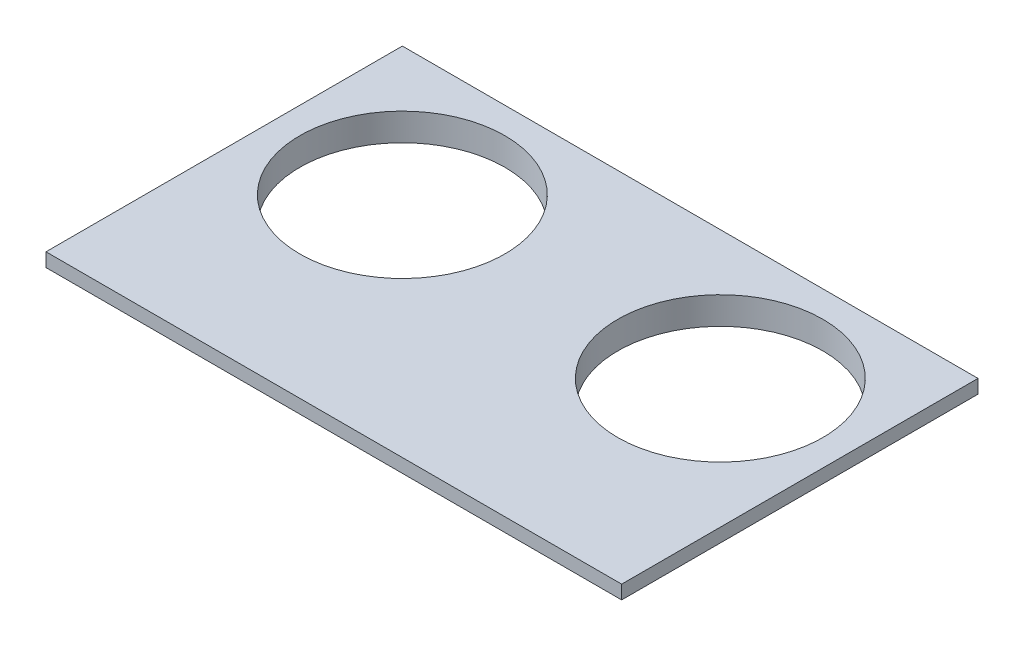
ISO-10303-21;
HEADER;
FILE_DESCRIPTION(('STEP AP214'),'2;1');
FILE_NAME('part.step','',(''),(''),'','','');
FILE_SCHEMA(('AUTOMOTIVE_DESIGN { 1 0 10303 214 1 1 1 1 }'));
ENDSEC;
DATA;
#1=APPLICATION_CONTEXT('core data for automotive mechanical design processes');
#2=APPLICATION_PROTOCOL_DEFINITION('international standard','automotive_design',2000,#1);
#3=PRODUCT_CONTEXT('',#1,'mechanical');
#4=PRODUCT('Part','Part','',(#3));
#5=PRODUCT_RELATED_PRODUCT_CATEGORY('part','',(#4));
#6=PRODUCT_DEFINITION_FORMATION('','',#4);
#7=PRODUCT_DEFINITION_CONTEXT('part definition',#1,'design');
#8=PRODUCT_DEFINITION('design','',#6,#7);
#9=PRODUCT_DEFINITION_SHAPE('','',#8);
#10=(LENGTH_UNIT() NAMED_UNIT(*) SI_UNIT(.MILLI.,.METRE.));
#11=(NAMED_UNIT(*) PLANE_ANGLE_UNIT() SI_UNIT($,.RADIAN.));
#12=(NAMED_UNIT(*) SI_UNIT($,.STERADIAN.) SOLID_ANGLE_UNIT());
#13=UNCERTAINTY_MEASURE_WITH_UNIT(LENGTH_MEASURE(1.E-05),#10,'distance_accuracy_value','');
#14=(GEOMETRIC_REPRESENTATION_CONTEXT(3) GLOBAL_UNCERTAINTY_ASSIGNED_CONTEXT((#13)) GLOBAL_UNIT_ASSIGNED_CONTEXT((#10,
#11,#12)) REPRESENTATION_CONTEXT('',''));
#15=CARTESIAN_POINT('',(0.,0.,0.));
#16=DIRECTION('',(0.,0.,1.));
#17=DIRECTION('',(1.,0.,0.));
#18=AXIS2_PLACEMENT_3D('',#15,#16,#17);
#19=CARTESIAN_POINT('',(52.5,5.,32.5));
#20=DIRECTION('',(-1.,0.,0.));
#21=DIRECTION('',(0.,0.,1.));
#22=AXIS2_PLACEMENT_3D('',#19,#20,#21);
#23=PLANE('',#22);
#24=DIRECTION('',(0.,-1.,0.));
#25=VECTOR('',#24,1.);
#26=CARTESIAN_POINT('',(52.5,5.,32.5));
#27=LINE('',#26,#25);
#28=CARTESIAN_POINT('',(52.5,5.,32.5));
#29=VERTEX_POINT('',#28);
#30=CARTESIAN_POINT('',(52.5,2.5,32.5));
#31=VERTEX_POINT('',#30);
#32=EDGE_CURVE('E189',#29,#31,#27,.T.);
#33=ORIENTED_EDGE('',*,*,#32,.T.);
#34=DIRECTION('',(0.,0.,1.));
#35=VECTOR('',#34,1.);
#36=CARTESIAN_POINT('',(52.5,2.5,-32.5));
#37=LINE('',#36,#35);
#38=CARTESIAN_POINT('',(52.5,2.5,-32.5));
#39=VERTEX_POINT('',#38);
#40=EDGE_CURVE('E60',#39,#31,#37,.T.);
#41=ORIENTED_EDGE('',*,*,#40,.F.);
#42=DIRECTION('',(0.,-1.,0.));
#43=VECTOR('',#42,1.);
#44=CARTESIAN_POINT('',(52.5,5.,-32.5));
#45=LINE('',#44,#43);
#46=CARTESIAN_POINT('',(52.5,5.,-32.5));
#47=VERTEX_POINT('',#46);
#48=EDGE_CURVE('E11',#47,#39,#45,.T.);
#49=ORIENTED_EDGE('',*,*,#48,.F.);
#50=DIRECTION('',(0.,0.,-1.));
#51=VECTOR('',#50,1.);
#52=CARTESIAN_POINT('',(52.5,5.,32.5));
#53=LINE('',#52,#51);
#54=EDGE_CURVE('E176',#29,#47,#53,.T.);
#55=ORIENTED_EDGE('',*,*,#54,.F.);
#56=EDGE_LOOP('',(#33,#41,#49,#55));
#57=FACE_BOUND('',#56,.T.);
#58=ADVANCED_FACE('F43',(#57),#23,.F.);
#59=CARTESIAN_POINT('',(-52.5,5.,-32.5));
#60=DIRECTION('',(0.,0.,1.));
#61=DIRECTION('',(1.,0.,0.));
#62=AXIS2_PLACEMENT_3D('',#59,#60,#61);
#63=PLANE('',#62);
#64=ORIENTED_EDGE('',*,*,#48,.T.);
#65=DIRECTION('',(1.,0.,0.));
#66=VECTOR('',#65,1.);
#67=CARTESIAN_POINT('',(-52.5,2.5,-32.5));
#68=LINE('',#67,#66);
#69=CARTESIAN_POINT('',(-52.5,2.5,-32.5));
#70=VERTEX_POINT('',#69);
#71=EDGE_CURVE('E173',#70,#39,#68,.T.);
#72=ORIENTED_EDGE('',*,*,#71,.F.);
#73=DIRECTION('',(0.,-1.,0.));
#74=VECTOR('',#73,1.);
#75=CARTESIAN_POINT('',(-52.5,5.,-32.5));
#76=LINE('',#75,#74);
#77=CARTESIAN_POINT('',(-52.5,5.,-32.5));
#78=VERTEX_POINT('',#77);
#79=EDGE_CURVE('E52',#78,#70,#76,.T.);
#80=ORIENTED_EDGE('',*,*,#79,.F.);
#81=DIRECTION('',(-1.,0.,0.));
#82=VECTOR('',#81,1.);
#83=CARTESIAN_POINT('',(-52.5,5.,-32.5));
#84=LINE('',#83,#82);
#85=EDGE_CURVE('E180',#47,#78,#84,.T.);
#86=ORIENTED_EDGE('',*,*,#85,.F.);
#87=EDGE_LOOP('',(#64,#72,#80,#86));
#88=FACE_BOUND('',#87,.T.);
#89=ADVANCED_FACE('F231',(#88),#63,.F.);
#90=CARTESIAN_POINT('',(-52.5,5.,32.5));
#91=DIRECTION('',(1.,0.,0.));
#92=DIRECTION('',(0.,0.,-1.));
#93=AXIS2_PLACEMENT_3D('',#90,#91,#92);
#94=PLANE('',#93);
#95=ORIENTED_EDGE('',*,*,#79,.T.);
#96=DIRECTION('',(0.,0.,-1.));
#97=VECTOR('',#96,1.);
#98=CARTESIAN_POINT('',(-52.5,2.5,-32.5));
#99=LINE('',#98,#97);
#100=CARTESIAN_POINT('',(-52.5,2.5,32.5));
#101=VERTEX_POINT('',#100);
#102=EDGE_CURVE('E170',#101,#70,#99,.T.);
#103=ORIENTED_EDGE('',*,*,#102,.F.);
#104=DIRECTION('',(0.,-1.,0.));
#105=VECTOR('',#104,1.);
#106=CARTESIAN_POINT('',(-52.5,5.,32.5));
#107=LINE('',#106,#105);
#108=CARTESIAN_POINT('',(-52.5,5.,32.5));
#109=VERTEX_POINT('',#108);
#110=EDGE_CURVE('E193',#109,#101,#107,.T.);
#111=ORIENTED_EDGE('',*,*,#110,.F.);
#112=DIRECTION('',(0.,0.,1.));
#113=VECTOR('',#112,1.);
#114=CARTESIAN_POINT('',(-52.5,5.,32.5));
#115=LINE('',#114,#113);
#116=EDGE_CURVE('E183',#78,#109,#115,.T.);
#117=ORIENTED_EDGE('',*,*,#116,.F.);
#118=EDGE_LOOP('',(#95,#103,#111,#117));
#119=FACE_BOUND('',#118,.T.);
#120=ADVANCED_FACE('F236',(#119),#94,.F.);
#121=CARTESIAN_POINT('',(-52.5,5.,32.5));
#122=DIRECTION('',(0.,0.,-1.));
#123=DIRECTION('',(-1.,0.,0.));
#124=AXIS2_PLACEMENT_3D('',#121,#122,#123);
#125=PLANE('',#124);
#126=ORIENTED_EDGE('',*,*,#110,.T.);
#127=DIRECTION('',(-1.,0.,0.));
#128=VECTOR('',#127,1.);
#129=CARTESIAN_POINT('',(-52.5,2.5,32.5));
#130=LINE('',#129,#128);
#131=EDGE_CURVE('E167',#31,#101,#130,.T.);
#132=ORIENTED_EDGE('',*,*,#131,.F.);
#133=ORIENTED_EDGE('',*,*,#32,.F.);
#134=DIRECTION('',(1.,0.,0.));
#135=VECTOR('',#134,1.);
#136=CARTESIAN_POINT('',(-52.5,5.,32.5));
#137=LINE('',#136,#135);
#138=EDGE_CURVE('E186',#109,#29,#137,.T.);
#139=ORIENTED_EDGE('',*,*,#138,.F.);
#140=EDGE_LOOP('',(#126,#132,#133,#139));
#141=FACE_BOUND('',#140,.T.);
#142=ADVANCED_FACE('F220',(#141),#125,.F.);
#143=CARTESIAN_POINT('',(0.,5.,0.));
#144=DIRECTION('',(0.,-1.,0.));
#145=DIRECTION('',(0.,0.,-1.));
#146=AXIS2_PLACEMENT_3D('',#143,#144,#145);
#147=PLANE('',#146);
#148=CARTESIAN_POINT('',(-29.,5.,-9.));
#149=DIRECTION('',(0.,1.,0.));
#150=DIRECTION('',(0.,0.,1.));
#151=AXIS2_PLACEMENT_3D('',#148,#149,#150);
#152=CIRCLE('',#151,18.7);
#153=CARTESIAN_POINT('',(-29.,5.,9.7));
#154=VERTEX_POINT('',#153);
#155=EDGE_CURVE('E202',#154,#154,#152,.T.);
#156=ORIENTED_EDGE('',*,*,#155,.F.);
#157=EDGE_LOOP('',(#156));
#158=FACE_BOUND('',#157,.T.);
#159=CARTESIAN_POINT('',(29.,5.,-9.));
#160=DIRECTION('',(0.,1.,0.));
#161=DIRECTION('',(0.,0.,1.));
#162=AXIS2_PLACEMENT_3D('',#159,#160,#161);
#163=CIRCLE('',#162,18.7);
#164=CARTESIAN_POINT('',(29.,5.,9.7));
#165=VERTEX_POINT('',#164);
#166=EDGE_CURVE('E144',#165,#165,#163,.T.);
#167=ORIENTED_EDGE('',*,*,#166,.F.);
#168=EDGE_LOOP('',(#167));
#169=FACE_BOUND('',#168,.T.);
#170=ORIENTED_EDGE('',*,*,#54,.T.);
#171=ORIENTED_EDGE('',*,*,#85,.T.);
#172=ORIENTED_EDGE('',*,*,#116,.T.);
#173=ORIENTED_EDGE('',*,*,#138,.T.);
#174=EDGE_LOOP('',(#170,#171,#172,#173));
#175=FACE_BOUND('',#174,.T.);
#176=ADVANCED_FACE('F217',(#158,#169,#175),#147,.F.);
#177=CARTESIAN_POINT('',(0.,2.5,0.));
#178=DIRECTION('',(0.,1.,0.));
#179=DIRECTION('',(0.,0.,1.));
#180=AXIS2_PLACEMENT_3D('',#177,#178,#179);
#181=PLANE('',#180);
#182=DIRECTION('',(0.,0.,1.));
#183=VECTOR('',#182,1.);
#184=CARTESIAN_POINT('',(50.,2.5,-30.));
#185=LINE('',#184,#183);
#186=CARTESIAN_POINT('',(50.,2.5,-30.));
#187=VERTEX_POINT('',#186);
#188=CARTESIAN_POINT('',(50.,2.5,30.));
#189=VERTEX_POINT('',#188);
#190=EDGE_CURVE('E129',#187,#189,#185,.T.);
#191=ORIENTED_EDGE('',*,*,#190,.F.);
#192=DIRECTION('',(1.,0.,0.));
#193=VECTOR('',#192,1.);
#194=CARTESIAN_POINT('',(-50.,2.5,-30.));
#195=LINE('',#194,#193);
#196=CARTESIAN_POINT('',(-50.,2.5,-30.));
#197=VERTEX_POINT('',#196);
#198=EDGE_CURVE('E123',#197,#187,#195,.T.);
#199=ORIENTED_EDGE('',*,*,#198,.F.);
#200=DIRECTION('',(0.,0.,-1.));
#201=VECTOR('',#200,1.);
#202=CARTESIAN_POINT('',(-50.,2.5,-30.));
#203=LINE('',#202,#201);
#204=CARTESIAN_POINT('',(-50.,2.5,30.));
#205=VERTEX_POINT('',#204);
#206=EDGE_CURVE('E132',#205,#197,#203,.T.);
#207=ORIENTED_EDGE('',*,*,#206,.F.);
#208=DIRECTION('',(-1.,0.,0.));
#209=VECTOR('',#208,1.);
#210=CARTESIAN_POINT('',(-50.,2.5,30.));
#211=LINE('',#210,#209);
#212=EDGE_CURVE('E114',#189,#205,#211,.T.);
#213=ORIENTED_EDGE('',*,*,#212,.F.);
#214=EDGE_LOOP('',(#191,#199,#207,#213));
#215=FACE_BOUND('',#214,.T.);
#216=ORIENTED_EDGE('',*,*,#40,.T.);
#217=ORIENTED_EDGE('',*,*,#131,.T.);
#218=ORIENTED_EDGE('',*,*,#102,.T.);
#219=ORIENTED_EDGE('',*,*,#71,.T.);
#220=EDGE_LOOP('',(#216,#217,#218,#219));
#221=FACE_BOUND('',#220,.T.);
#222=ADVANCED_FACE('F127',(#215,#221),#181,.F.);
#223=CARTESIAN_POINT('',(50.,2.5,-30.));
#224=DIRECTION('',(1.,0.,0.));
#225=DIRECTION('',(0.,0.,-1.));
#226=AXIS2_PLACEMENT_3D('',#223,#224,#225);
#227=PLANE('',#226);
#228=DIRECTION('',(0.,0.,1.));
#229=VECTOR('',#228,1.);
#230=CARTESIAN_POINT('',(50.,0.,-30.));
#231=LINE('',#230,#229);
#232=CARTESIAN_POINT('',(50.,0.,-30.));
#233=VERTEX_POINT('',#232);
#234=CARTESIAN_POINT('',(50.,0.,30.));
#235=VERTEX_POINT('',#234);
#236=EDGE_CURVE('E151',#233,#235,#231,.T.);
#237=ORIENTED_EDGE('',*,*,#236,.F.);
#238=DIRECTION('',(0.,-1.,0.));
#239=VECTOR('',#238,1.);
#240=CARTESIAN_POINT('',(50.,2.5,-30.));
#241=LINE('',#240,#239);
#242=EDGE_CURVE('E136',#187,#233,#241,.T.);
#243=ORIENTED_EDGE('',*,*,#242,.F.);
#244=ORIENTED_EDGE('',*,*,#190,.T.);
#245=DIRECTION('',(0.,-1.,0.));
#246=VECTOR('',#245,1.);
#247=CARTESIAN_POINT('',(50.,2.5,30.));
#248=LINE('',#247,#246);
#249=EDGE_CURVE('E111',#189,#235,#248,.T.);
#250=ORIENTED_EDGE('',*,*,#249,.T.);
#251=EDGE_LOOP('',(#237,#243,#244,#250));
#252=FACE_BOUND('',#251,.T.);
#253=ADVANCED_FACE('F135',(#252),#227,.T.);
#254=CARTESIAN_POINT('',(-50.,2.5,-30.));
#255=DIRECTION('',(0.,0.,-1.));
#256=DIRECTION('',(-1.,0.,0.));
#257=AXIS2_PLACEMENT_3D('',#254,#255,#256);
#258=PLANE('',#257);
#259=DIRECTION('',(1.,0.,0.));
#260=VECTOR('',#259,1.);
#261=CARTESIAN_POINT('',(-50.,0.,-30.));
#262=LINE('',#261,#260);
#263=CARTESIAN_POINT('',(-50.,0.,-30.));
#264=VERTEX_POINT('',#263);
#265=EDGE_CURVE('E138',#264,#233,#262,.T.);
#266=ORIENTED_EDGE('',*,*,#265,.F.);
#267=DIRECTION('',(0.,-1.,0.));
#268=VECTOR('',#267,1.);
#269=CARTESIAN_POINT('',(-50.,2.5,-30.));
#270=LINE('',#269,#268);
#271=EDGE_CURVE('E160',#197,#264,#270,.T.);
#272=ORIENTED_EDGE('',*,*,#271,.F.);
#273=ORIENTED_EDGE('',*,*,#198,.T.);
#274=ORIENTED_EDGE('',*,*,#242,.T.);
#275=EDGE_LOOP('',(#266,#272,#273,#274));
#276=FACE_BOUND('',#275,.T.);
#277=ADVANCED_FACE('F243',(#276),#258,.T.);
#278=CARTESIAN_POINT('',(-50.,2.5,-30.));
#279=DIRECTION('',(-1.,0.,0.));
#280=DIRECTION('',(0.,0.,1.));
#281=AXIS2_PLACEMENT_3D('',#278,#279,#280);
#282=PLANE('',#281);
#283=DIRECTION('',(0.,0.,-1.));
#284=VECTOR('',#283,1.);
#285=CARTESIAN_POINT('',(-50.,0.,-30.));
#286=LINE('',#285,#284);
#287=CARTESIAN_POINT('',(-50.,0.,30.));
#288=VERTEX_POINT('',#287);
#289=EDGE_CURVE('E68',#288,#264,#286,.T.);
#290=ORIENTED_EDGE('',*,*,#289,.F.);
#291=DIRECTION('',(0.,-1.,0.));
#292=VECTOR('',#291,1.);
#293=CARTESIAN_POINT('',(-50.,2.5,30.));
#294=LINE('',#293,#292);
#295=EDGE_CURVE('E122',#205,#288,#294,.T.);
#296=ORIENTED_EDGE('',*,*,#295,.F.);
#297=ORIENTED_EDGE('',*,*,#206,.T.);
#298=ORIENTED_EDGE('',*,*,#271,.T.);
#299=EDGE_LOOP('',(#290,#296,#297,#298));
#300=FACE_BOUND('',#299,.T.);
#301=ADVANCED_FACE('F265',(#300),#282,.T.);
#302=CARTESIAN_POINT('',(-50.,2.5,30.));
#303=DIRECTION('',(0.,0.,1.));
#304=DIRECTION('',(1.,0.,0.));
#305=AXIS2_PLACEMENT_3D('',#302,#303,#304);
#306=PLANE('',#305);
#307=DIRECTION('',(-1.,0.,0.));
#308=VECTOR('',#307,1.);
#309=CARTESIAN_POINT('',(-50.,0.,30.));
#310=LINE('',#309,#308);
#311=EDGE_CURVE('E116',#235,#288,#310,.T.);
#312=ORIENTED_EDGE('',*,*,#311,.F.);
#313=ORIENTED_EDGE('',*,*,#249,.F.);
#314=ORIENTED_EDGE('',*,*,#212,.T.);
#315=ORIENTED_EDGE('',*,*,#295,.T.);
#316=EDGE_LOOP('',(#312,#313,#314,#315));
#317=FACE_BOUND('',#316,.T.);
#318=ADVANCED_FACE('F113',(#317),#306,.T.);
#319=CARTESIAN_POINT('',(0.,0.,0.));
#320=DIRECTION('',(0.,-1.,0.));
#321=DIRECTION('',(0.,0.,-1.));
#322=AXIS2_PLACEMENT_3D('',#319,#320,#321);
#323=PLANE('',#322);
#324=CARTESIAN_POINT('',(-29.,0.,-9.));
#325=DIRECTION('',(0.,-1.,0.));
#326=DIRECTION('',(0.,0.,-1.));
#327=AXIS2_PLACEMENT_3D('',#324,#325,#326);
#328=CIRCLE('',#327,18.7);
#329=CARTESIAN_POINT('',(-29.,0.,-27.7));
#330=VERTEX_POINT('',#329);
#331=EDGE_CURVE('E46',#330,#330,#328,.T.);
#332=ORIENTED_EDGE('',*,*,#331,.F.);
#333=EDGE_LOOP('',(#332));
#334=FACE_BOUND('',#333,.T.);
#335=CARTESIAN_POINT('',(29.,0.,-9.));
#336=DIRECTION('',(0.,-1.,0.));
#337=DIRECTION('',(0.,0.,-1.));
#338=AXIS2_PLACEMENT_3D('',#335,#336,#337);
#339=CIRCLE('',#338,18.7);
#340=CARTESIAN_POINT('',(29.,0.,-27.7));
#341=VERTEX_POINT('',#340);
#342=EDGE_CURVE('E199',#341,#341,#339,.T.);
#343=ORIENTED_EDGE('',*,*,#342,.F.);
#344=EDGE_LOOP('',(#343));
#345=FACE_BOUND('',#344,.T.);
#346=ORIENTED_EDGE('',*,*,#265,.T.);
#347=ORIENTED_EDGE('',*,*,#236,.T.);
#348=ORIENTED_EDGE('',*,*,#311,.T.);
#349=ORIENTED_EDGE('',*,*,#289,.T.);
#350=EDGE_LOOP('',(#346,#347,#348,#349));
#351=FACE_BOUND('',#350,.T.);
#352=ADVANCED_FACE('F256',(#334,#345,#351),#323,.T.);
#353=CARTESIAN_POINT('',(29.,-45.,-9.));
#354=DIRECTION('',(0.,1.,0.));
#355=DIRECTION('',(0.,0.,1.));
#356=AXIS2_PLACEMENT_3D('',#353,#354,#355);
#357=CYLINDRICAL_SURFACE('',#356,18.7);
#358=ORIENTED_EDGE('',*,*,#342,.T.);
#359=EDGE_LOOP('',(#358));
#360=FACE_BOUND('',#359,.T.);
#361=ORIENTED_EDGE('',*,*,#166,.T.);
#362=EDGE_LOOP('',(#361));
#363=FACE_BOUND('',#362,.T.);
#364=ADVANCED_FACE('F215',(#360,#363),#357,.F.);
#365=CARTESIAN_POINT('',(-29.,-45.,-9.));
#366=DIRECTION('',(0.,1.,0.));
#367=DIRECTION('',(0.,0.,1.));
#368=AXIS2_PLACEMENT_3D('',#365,#366,#367);
#369=CYLINDRICAL_SURFACE('',#368,18.7);
#370=ORIENTED_EDGE('',*,*,#331,.T.);
#371=EDGE_LOOP('',(#370));
#372=FACE_BOUND('',#371,.T.);
#373=ORIENTED_EDGE('',*,*,#155,.T.);
#374=EDGE_LOOP('',(#373));
#375=FACE_BOUND('',#374,.T.);
#376=ADVANCED_FACE('F263',(#372,#375),#369,.F.);
#377=CLOSED_SHELL('',(#58,#89,#120,#142,#176,#222,#253,#277,#301,#318,#352,#364,#376));
#378=MANIFOLD_SOLID_BREP('B2',#377);
#379=ADVANCED_BREP_SHAPE_REPRESENTATION('',(#18,#378),#14);
#380=SHAPE_DEFINITION_REPRESENTATION(#9,#379);
ENDSEC;
END-ISO-10303-21;
